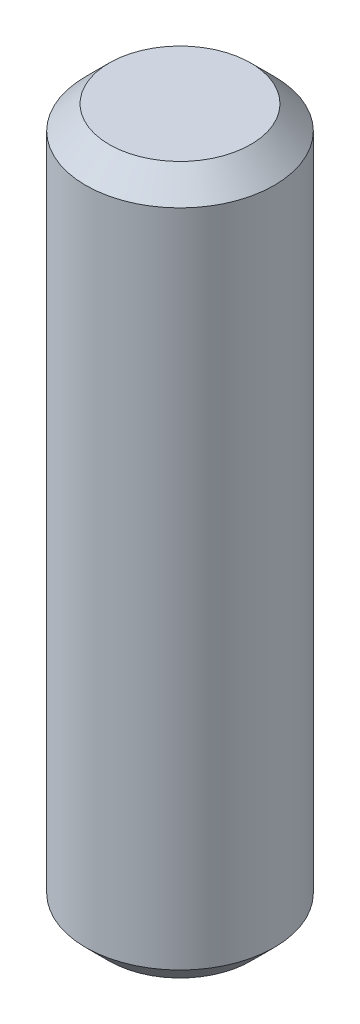
ISO-10303-21;
HEADER;
FILE_DESCRIPTION(('STEP AP214'),'2;1');
FILE_NAME('part.step','',(''),(''),'','','');
FILE_SCHEMA(('AUTOMOTIVE_DESIGN { 1 0 10303 214 1 1 1 1 }'));
ENDSEC;
DATA;
#1=APPLICATION_CONTEXT('core data for automotive mechanical design processes');
#2=APPLICATION_PROTOCOL_DEFINITION('international standard','automotive_design',2000,#1);
#3=PRODUCT_CONTEXT('',#1,'mechanical');
#4=PRODUCT('Part','Part','',(#3));
#5=PRODUCT_RELATED_PRODUCT_CATEGORY('part','',(#4));
#6=PRODUCT_DEFINITION_FORMATION('','',#4);
#7=PRODUCT_DEFINITION_CONTEXT('part definition',#1,'design');
#8=PRODUCT_DEFINITION('design','',#6,#7);
#9=PRODUCT_DEFINITION_SHAPE('','',#8);
#10=(LENGTH_UNIT() NAMED_UNIT(*) SI_UNIT(.MILLI.,.METRE.));
#11=(NAMED_UNIT(*) PLANE_ANGLE_UNIT() SI_UNIT($,.RADIAN.));
#12=(NAMED_UNIT(*) SI_UNIT($,.STERADIAN.) SOLID_ANGLE_UNIT());
#13=UNCERTAINTY_MEASURE_WITH_UNIT(LENGTH_MEASURE(1.E-05),#10,'distance_accuracy_value','');
#14=(GEOMETRIC_REPRESENTATION_CONTEXT(3) GLOBAL_UNCERTAINTY_ASSIGNED_CONTEXT((#13)) GLOBAL_UNIT_ASSIGNED_CONTEXT((#10,
#11,#12)) REPRESENTATION_CONTEXT('',''));
#15=CARTESIAN_POINT('',(0.,0.,0.));
#16=DIRECTION('',(0.,0.,1.));
#17=DIRECTION('',(1.,0.,0.));
#18=AXIS2_PLACEMENT_3D('',#15,#16,#17);
#19=CARTESIAN_POINT('',(0.,15.,0.));
#20=DIRECTION('',(0.,-1.,0.));
#21=DIRECTION('',(0.,0.,-1.));
#22=AXIS2_PLACEMENT_3D('',#19,#20,#21);
#23=CYLINDRICAL_SURFACE('',#22,2.);
#24=CARTESIAN_POINT('',(0.,0.500000000000006,0.));
#25=DIRECTION('',(0.,1.,0.));
#26=DIRECTION('',(0.,0.,1.));
#27=AXIS2_PLACEMENT_3D('',#24,#25,#26);
#28=CIRCLE('',#27,2.);
#29=CARTESIAN_POINT('',(0.,0.500000000000006,2.));
#30=VERTEX_POINT('',#29);
#31=EDGE_CURVE('E42',#30,#30,#28,.T.);
#32=ORIENTED_EDGE('',*,*,#31,.T.);
#33=EDGE_LOOP('',(#32));
#34=FACE_BOUND('',#33,.T.);
#35=CARTESIAN_POINT('',(0.,14.5,0.));
#36=DIRECTION('',(0.,1.,0.));
#37=DIRECTION('',(0.,0.,1.));
#38=AXIS2_PLACEMENT_3D('',#35,#36,#37);
#39=CIRCLE('',#38,2.);
#40=CARTESIAN_POINT('',(0.,14.5,2.));
#41=VERTEX_POINT('',#40);
#42=EDGE_CURVE('E46',#41,#41,#39,.F.);
#43=ORIENTED_EDGE('',*,*,#42,.T.);
#44=EDGE_LOOP('',(#43));
#45=FACE_BOUND('',#44,.T.);
#46=ADVANCED_FACE('F34',(#34,#45),#23,.T.);
#47=CARTESIAN_POINT('',(0.,15.,0.));
#48=DIRECTION('',(0.,1.,0.));
#49=DIRECTION('',(0.,0.,1.));
#50=AXIS2_PLACEMENT_3D('',#47,#48,#49);
#51=PLANE('',#50);
#52=CARTESIAN_POINT('',(0.,15.,0.));
#53=DIRECTION('',(0.,1.,0.));
#54=DIRECTION('',(0.,0.,1.));
#55=AXIS2_PLACEMENT_3D('',#52,#53,#54);
#56=CIRCLE('',#55,1.5);
#57=CARTESIAN_POINT('',(0.,15.,1.5));
#58=VERTEX_POINT('',#57);
#59=EDGE_CURVE('E50',#58,#58,#56,.T.);
#60=ORIENTED_EDGE('',*,*,#59,.T.);
#61=EDGE_LOOP('',(#60));
#62=FACE_BOUND('',#61,.T.);
#63=ADVANCED_FACE('F56',(#62),#51,.T.);
#64=CARTESIAN_POINT('',(0.,0.,0.));
#65=DIRECTION('',(0.,1.,0.));
#66=DIRECTION('',(0.,0.,1.));
#67=AXIS2_PLACEMENT_3D('',#64,#65,#66);
#68=PLANE('',#67);
#69=CARTESIAN_POINT('',(0.,0.,0.));
#70=DIRECTION('',(0.,1.,0.));
#71=DIRECTION('',(0.,0.,1.));
#72=AXIS2_PLACEMENT_3D('',#69,#70,#71);
#73=CIRCLE('',#72,1.49999999999999);
#74=CARTESIAN_POINT('',(0.,0.,1.49999999999999));
#75=VERTEX_POINT('',#74);
#76=EDGE_CURVE('E10',#75,#75,#73,.F.);
#77=ORIENTED_EDGE('',*,*,#76,.T.);
#78=EDGE_LOOP('',(#77));
#79=FACE_BOUND('',#78,.T.);
#80=ADVANCED_FACE('F60',(#79),#68,.F.);
#81=CARTESIAN_POINT('',(0.,15.,0.));
#82=DIRECTION('',(0.,-1.,0.));
#83=DIRECTION('',(0.,0.,-1.));
#84=AXIS2_PLACEMENT_3D('',#81,#82,#83);
#85=CONICAL_SURFACE('',#84,1.5,0.785398163397447);
#86=ORIENTED_EDGE('',*,*,#42,.F.);
#87=EDGE_LOOP('',(#86));
#88=FACE_BOUND('',#87,.T.);
#89=ORIENTED_EDGE('',*,*,#59,.F.);
#90=EDGE_LOOP('',(#89));
#91=FACE_BOUND('',#90,.T.);
#92=ADVANCED_FACE('F58',(#88,#91),#85,.T.);
#93=CARTESIAN_POINT('',(0.,0.500000000000006,0.));
#94=DIRECTION('',(0.,1.,0.));
#95=DIRECTION('',(0.,0.,1.));
#96=AXIS2_PLACEMENT_3D('',#93,#94,#95);
#97=CONICAL_SURFACE('',#96,2.,0.78539816339745);
#98=ORIENTED_EDGE('',*,*,#76,.F.);
#99=EDGE_LOOP('',(#98));
#100=FACE_BOUND('',#99,.T.);
#101=ORIENTED_EDGE('',*,*,#31,.F.);
#102=EDGE_LOOP('',(#101));
#103=FACE_BOUND('',#102,.T.);
#104=ADVANCED_FACE('F37',(#100,#103),#97,.T.);
#105=CLOSED_SHELL('',(#46,#63,#80,#92,#104));
#106=MANIFOLD_SOLID_BREP('B2',#105);
#107=ADVANCED_BREP_SHAPE_REPRESENTATION('',(#18,#106),#14);
#108=SHAPE_DEFINITION_REPRESENTATION(#9,#107);
ENDSEC;
END-ISO-10303-21;
